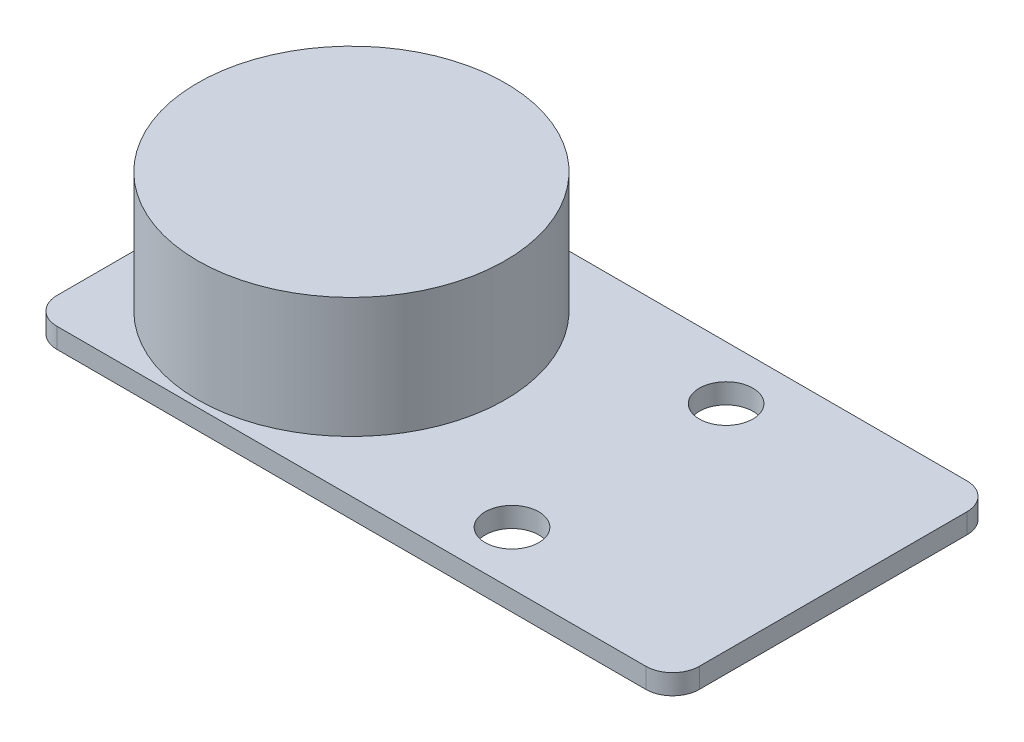
ISO-10303-21;
HEADER;
FILE_DESCRIPTION(('STEP AP214'),'2;1');
FILE_NAME('part.step','',(''),(''),'','','');
FILE_SCHEMA(('AUTOMOTIVE_DESIGN { 1 0 10303 214 1 1 1 1 }'));
ENDSEC;
DATA;
#1=APPLICATION_CONTEXT('core data for automotive mechanical design processes');
#2=APPLICATION_PROTOCOL_DEFINITION('international standard','automotive_design',2000,#1);
#3=PRODUCT_CONTEXT('',#1,'mechanical');
#4=PRODUCT('Part','Part','',(#3));
#5=PRODUCT_RELATED_PRODUCT_CATEGORY('part','',(#4));
#6=PRODUCT_DEFINITION_FORMATION('','',#4);
#7=PRODUCT_DEFINITION_CONTEXT('part definition',#1,'design');
#8=PRODUCT_DEFINITION('design','',#6,#7);
#9=PRODUCT_DEFINITION_SHAPE('','',#8);
#10=(LENGTH_UNIT() NAMED_UNIT(*) SI_UNIT(.MILLI.,.METRE.));
#11=(NAMED_UNIT(*) PLANE_ANGLE_UNIT() SI_UNIT($,.RADIAN.));
#12=(NAMED_UNIT(*) SI_UNIT($,.STERADIAN.) SOLID_ANGLE_UNIT());
#13=UNCERTAINTY_MEASURE_WITH_UNIT(LENGTH_MEASURE(1.E-05),#10,'distance_accuracy_value','');
#14=(GEOMETRIC_REPRESENTATION_CONTEXT(3) GLOBAL_UNCERTAINTY_ASSIGNED_CONTEXT((#13)) GLOBAL_UNIT_ASSIGNED_CONTEXT((#10,
#11,#12)) REPRESENTATION_CONTEXT('',''));
#15=CARTESIAN_POINT('',(0.,0.,0.));
#16=DIRECTION('',(0.,0.,1.));
#17=DIRECTION('',(1.,0.,0.));
#18=AXIS2_PLACEMENT_3D('',#15,#16,#17);
#19=CARTESIAN_POINT('',(-24.,1.5,12.));
#20=DIRECTION('',(1.,0.,0.));
#21=DIRECTION('',(0.,0.,-1.));
#22=AXIS2_PLACEMENT_3D('',#19,#20,#21);
#23=PLANE('',#22);
#24=DIRECTION('',(0.,0.,1.));
#25=VECTOR('',#24,1.);
#26=CARTESIAN_POINT('',(-24.,1.5,12.));
#27=LINE('',#26,#25);
#28=CARTESIAN_POINT('',(-24.,1.5,-9.99999999999999));
#29=VERTEX_POINT('',#28);
#30=CARTESIAN_POINT('',(-24.,1.5,10.));
#31=VERTEX_POINT('',#30);
#32=EDGE_CURVE('E140',#29,#31,#27,.T.);
#33=ORIENTED_EDGE('',*,*,#32,.F.);
#34=DIRECTION('',(0.,-1.,0.));
#35=VECTOR('',#34,1.);
#36=CARTESIAN_POINT('',(-24.,1.5,-9.99999999999999));
#37=LINE('',#36,#35);
#38=CARTESIAN_POINT('',(-24.,0.,-9.99999999999999));
#39=VERTEX_POINT('',#38);
#40=EDGE_CURVE('E11',#29,#39,#37,.T.);
#41=ORIENTED_EDGE('',*,*,#40,.T.);
#42=DIRECTION('',(0.,0.,1.));
#43=VECTOR('',#42,1.);
#44=CARTESIAN_POINT('',(-24.,0.,12.));
#45=LINE('',#44,#43);
#46=CARTESIAN_POINT('',(-24.,0.,10.));
#47=VERTEX_POINT('',#46);
#48=EDGE_CURVE('E142',#39,#47,#45,.T.);
#49=ORIENTED_EDGE('',*,*,#48,.T.);
#50=DIRECTION('',(0.,-1.,0.));
#51=VECTOR('',#50,1.);
#52=CARTESIAN_POINT('',(-24.,1.5,10.));
#53=LINE('',#52,#51);
#54=EDGE_CURVE('E48',#47,#31,#53,.F.);
#55=ORIENTED_EDGE('',*,*,#54,.T.);
#56=EDGE_LOOP('',(#33,#41,#49,#55));
#57=FACE_BOUND('',#56,.T.);
#58=ADVANCED_FACE('F39',(#57),#23,.F.);
#59=CARTESIAN_POINT('',(24.,1.5,12.));
#60=DIRECTION('',(0.,0.,-1.));
#61=DIRECTION('',(-1.,0.,0.));
#62=AXIS2_PLACEMENT_3D('',#59,#60,#61);
#63=PLANE('',#62);
#64=DIRECTION('',(1.,0.,0.));
#65=VECTOR('',#64,1.);
#66=CARTESIAN_POINT('',(24.,0.,12.));
#67=LINE('',#66,#65);
#68=CARTESIAN_POINT('',(-22.,0.,12.));
#69=VERTEX_POINT('',#68);
#70=CARTESIAN_POINT('',(22.,0.,12.));
#71=VERTEX_POINT('',#70);
#72=EDGE_CURVE('E136',#69,#71,#67,.T.);
#73=ORIENTED_EDGE('',*,*,#72,.T.);
#74=DIRECTION('',(0.,-1.,0.));
#75=VECTOR('',#74,1.);
#76=CARTESIAN_POINT('',(22.,1.5,12.));
#77=LINE('',#76,#75);
#78=CARTESIAN_POINT('',(22.,1.5,12.));
#79=VERTEX_POINT('',#78);
#80=EDGE_CURVE('E112',#71,#79,#77,.F.);
#81=ORIENTED_EDGE('',*,*,#80,.T.);
#82=DIRECTION('',(1.,0.,0.));
#83=VECTOR('',#82,1.);
#84=CARTESIAN_POINT('',(24.,1.5,12.));
#85=LINE('',#84,#83);
#86=CARTESIAN_POINT('',(-22.,1.5,12.));
#87=VERTEX_POINT('',#86);
#88=EDGE_CURVE('E192',#87,#79,#85,.T.);
#89=ORIENTED_EDGE('',*,*,#88,.F.);
#90=DIRECTION('',(0.,-1.,0.));
#91=VECTOR('',#90,1.);
#92=CARTESIAN_POINT('',(-22.,1.5,12.));
#93=LINE('',#92,#91);
#94=EDGE_CURVE('E118',#87,#69,#93,.T.);
#95=ORIENTED_EDGE('',*,*,#94,.T.);
#96=EDGE_LOOP('',(#73,#81,#89,#95));
#97=FACE_BOUND('',#96,.T.);
#98=ADVANCED_FACE('F196',(#97),#63,.F.);
#99=CARTESIAN_POINT('',(24.,1.5,12.));
#100=DIRECTION('',(-1.,0.,0.));
#101=DIRECTION('',(0.,0.,1.));
#102=AXIS2_PLACEMENT_3D('',#99,#100,#101);
#103=PLANE('',#102);
#104=DIRECTION('',(0.,0.,-1.));
#105=VECTOR('',#104,1.);
#106=CARTESIAN_POINT('',(24.,1.5,12.));
#107=LINE('',#106,#105);
#108=CARTESIAN_POINT('',(24.,1.5,10.));
#109=VERTEX_POINT('',#108);
#110=CARTESIAN_POINT('',(24.,1.5,-10.));
#111=VERTEX_POINT('',#110);
#112=EDGE_CURVE('E127',#109,#111,#107,.T.);
#113=ORIENTED_EDGE('',*,*,#112,.F.);
#114=DIRECTION('',(0.,-1.,0.));
#115=VECTOR('',#114,1.);
#116=CARTESIAN_POINT('',(24.,1.5,10.));
#117=LINE('',#116,#115);
#118=CARTESIAN_POINT('',(24.,0.,10.));
#119=VERTEX_POINT('',#118);
#120=EDGE_CURVE('E111',#109,#119,#117,.T.);
#121=ORIENTED_EDGE('',*,*,#120,.T.);
#122=DIRECTION('',(0.,0.,-1.));
#123=VECTOR('',#122,1.);
#124=CARTESIAN_POINT('',(24.,0.,12.));
#125=LINE('',#124,#123);
#126=CARTESIAN_POINT('',(24.,0.,-10.));
#127=VERTEX_POINT('',#126);
#128=EDGE_CURVE('E125',#119,#127,#125,.T.);
#129=ORIENTED_EDGE('',*,*,#128,.T.);
#130=DIRECTION('',(0.,-1.,0.));
#131=VECTOR('',#130,1.);
#132=CARTESIAN_POINT('',(24.,1.5,-10.));
#133=LINE('',#132,#131);
#134=EDGE_CURVE('E130',#127,#111,#133,.F.);
#135=ORIENTED_EDGE('',*,*,#134,.T.);
#136=EDGE_LOOP('',(#113,#121,#129,#135));
#137=FACE_BOUND('',#136,.T.);
#138=ADVANCED_FACE('F124',(#137),#103,.F.);
#139=CARTESIAN_POINT('',(24.,1.5,-12.));
#140=DIRECTION('',(0.,0.,1.));
#141=DIRECTION('',(1.,0.,0.));
#142=AXIS2_PLACEMENT_3D('',#139,#140,#141);
#143=PLANE('',#142);
#144=DIRECTION('',(-1.,0.,0.));
#145=VECTOR('',#144,1.);
#146=CARTESIAN_POINT('',(24.,1.5,-12.));
#147=LINE('',#146,#145);
#148=CARTESIAN_POINT('',(22.,1.5,-12.));
#149=VERTEX_POINT('',#148);
#150=CARTESIAN_POINT('',(-22.,1.5,-12.));
#151=VERTEX_POINT('',#150);
#152=EDGE_CURVE('E147',#149,#151,#147,.T.);
#153=ORIENTED_EDGE('',*,*,#152,.F.);
#154=DIRECTION('',(0.,-1.,0.));
#155=VECTOR('',#154,1.);
#156=CARTESIAN_POINT('',(22.,1.5,-12.));
#157=LINE('',#156,#155);
#158=CARTESIAN_POINT('',(22.,0.,-12.));
#159=VERTEX_POINT('',#158);
#160=EDGE_CURVE('E174',#149,#159,#157,.T.);
#161=ORIENTED_EDGE('',*,*,#160,.T.);
#162=DIRECTION('',(-1.,0.,0.));
#163=VECTOR('',#162,1.);
#164=CARTESIAN_POINT('',(24.,0.,-12.));
#165=LINE('',#164,#163);
#166=CARTESIAN_POINT('',(-22.,0.,-12.));
#167=VERTEX_POINT('',#166);
#168=EDGE_CURVE('E135',#159,#167,#165,.T.);
#169=ORIENTED_EDGE('',*,*,#168,.T.);
#170=DIRECTION('',(0.,-1.,0.));
#171=VECTOR('',#170,1.);
#172=CARTESIAN_POINT('',(-22.,1.5,-12.));
#173=LINE('',#172,#171);
#174=EDGE_CURVE('E55',#167,#151,#173,.F.);
#175=ORIENTED_EDGE('',*,*,#174,.T.);
#176=EDGE_LOOP('',(#153,#161,#169,#175));
#177=FACE_BOUND('',#176,.T.);
#178=ADVANCED_FACE('F241',(#177),#143,.F.);
#179=CARTESIAN_POINT('',(0.,1.5,0.));
#180=DIRECTION('',(0.,1.,0.));
#181=DIRECTION('',(0.,0.,1.));
#182=AXIS2_PLACEMENT_3D('',#179,#180,#181);
#183=PLANE('',#182);
#184=CARTESIAN_POINT('',(-12.,1.5,0.));
#185=DIRECTION('',(0.,1.,0.));
#186=DIRECTION('',(0.,0.,1.));
#187=AXIS2_PLACEMENT_3D('',#184,#185,#186);
#188=CIRCLE('',#187,11.5);
#189=CARTESIAN_POINT('',(-12.,1.5,11.5));
#190=VERTEX_POINT('',#189);
#191=EDGE_CURVE('E222',#190,#190,#188,.T.);
#192=ORIENTED_EDGE('',*,*,#191,.F.);
#193=EDGE_LOOP('',(#192));
#194=FACE_BOUND('',#193,.T.);
#195=CARTESIAN_POINT('',(8.,1.5,-8.));
#196=DIRECTION('',(0.,1.,0.));
#197=DIRECTION('',(0.,0.,1.));
#198=AXIS2_PLACEMENT_3D('',#195,#196,#197);
#199=CIRCLE('',#198,2.);
#200=CARTESIAN_POINT('',(8.,1.5,-6.));
#201=VERTEX_POINT('',#200);
#202=EDGE_CURVE('E201',#201,#201,#199,.T.);
#203=ORIENTED_EDGE('',*,*,#202,.F.);
#204=EDGE_LOOP('',(#203));
#205=FACE_BOUND('',#204,.T.);
#206=CARTESIAN_POINT('',(8.,1.5,8.00000000000001));
#207=DIRECTION('',(0.,1.,0.));
#208=DIRECTION('',(0.,0.,-1.));
#209=AXIS2_PLACEMENT_3D('',#206,#207,#208);
#210=CIRCLE('',#209,2.);
#211=CARTESIAN_POINT('',(8.,1.5,6.00000000000001));
#212=VERTEX_POINT('',#211);
#213=EDGE_CURVE('E214',#212,#212,#210,.T.);
#214=ORIENTED_EDGE('',*,*,#213,.F.);
#215=EDGE_LOOP('',(#214));
#216=FACE_BOUND('',#215,.T.);
#217=ORIENTED_EDGE('',*,*,#88,.T.);
#218=CARTESIAN_POINT('',(22.,1.5,10.));
#219=DIRECTION('',(0.,1.,0.));
#220=DIRECTION('',(0.,0.,1.));
#221=AXIS2_PLACEMENT_3D('',#218,#219,#220);
#222=CIRCLE('',#221,2.);
#223=EDGE_CURVE('E169',#79,#109,#222,.T.);
#224=ORIENTED_EDGE('',*,*,#223,.T.);
#225=ORIENTED_EDGE('',*,*,#112,.T.);
#226=CARTESIAN_POINT('',(22.,1.5,-10.));
#227=DIRECTION('',(0.,1.,0.));
#228=DIRECTION('',(0.,0.,1.));
#229=AXIS2_PLACEMENT_3D('',#226,#227,#228);
#230=CIRCLE('',#229,2.);
#231=EDGE_CURVE('E62',#111,#149,#230,.T.);
#232=ORIENTED_EDGE('',*,*,#231,.T.);
#233=ORIENTED_EDGE('',*,*,#152,.T.);
#234=CARTESIAN_POINT('',(-22.,1.5,-9.99999999999999));
#235=DIRECTION('',(0.,1.,0.));
#236=DIRECTION('',(0.,0.,1.));
#237=AXIS2_PLACEMENT_3D('',#234,#235,#236);
#238=CIRCLE('',#237,2.);
#239=EDGE_CURVE('E164',#151,#29,#238,.T.);
#240=ORIENTED_EDGE('',*,*,#239,.T.);
#241=ORIENTED_EDGE('',*,*,#32,.T.);
#242=CARTESIAN_POINT('',(-22.,1.5,10.));
#243=DIRECTION('',(0.,1.,0.));
#244=DIRECTION('',(0.,0.,1.));
#245=AXIS2_PLACEMENT_3D('',#242,#243,#244);
#246=CIRCLE('',#245,2.);
#247=EDGE_CURVE('E161',#31,#87,#246,.T.);
#248=ORIENTED_EDGE('',*,*,#247,.T.);
#249=EDGE_LOOP('',(#217,#224,#225,#232,#233,#240,#241,#248));
#250=FACE_BOUND('',#249,.T.);
#251=ADVANCED_FACE('F188',(#194,#205,#216,#250),#183,.T.);
#252=CARTESIAN_POINT('',(0.,0.,0.));
#253=DIRECTION('',(0.,1.,0.));
#254=DIRECTION('',(0.,0.,1.));
#255=AXIS2_PLACEMENT_3D('',#252,#253,#254);
#256=PLANE('',#255);
#257=CARTESIAN_POINT('',(8.,0.,-8.));
#258=DIRECTION('',(0.,1.,0.));
#259=DIRECTION('',(0.,0.,1.));
#260=AXIS2_PLACEMENT_3D('',#257,#258,#259);
#261=CIRCLE('',#260,2.);
#262=CARTESIAN_POINT('',(8.,0.,-6.));
#263=VERTEX_POINT('',#262);
#264=EDGE_CURVE('E198',#263,#263,#261,.F.);
#265=ORIENTED_EDGE('',*,*,#264,.F.);
#266=EDGE_LOOP('',(#265));
#267=FACE_BOUND('',#266,.T.);
#268=CARTESIAN_POINT('',(8.,0.,8.00000000000001));
#269=DIRECTION('',(0.,1.,0.));
#270=DIRECTION('',(0.,0.,1.));
#271=AXIS2_PLACEMENT_3D('',#268,#269,#270);
#272=CIRCLE('',#271,2.);
#273=CARTESIAN_POINT('',(8.,0.,10.));
#274=VERTEX_POINT('',#273);
#275=EDGE_CURVE('E210',#274,#274,#272,.F.);
#276=ORIENTED_EDGE('',*,*,#275,.F.);
#277=EDGE_LOOP('',(#276));
#278=FACE_BOUND('',#277,.T.);
#279=ORIENTED_EDGE('',*,*,#128,.F.);
#280=CARTESIAN_POINT('',(22.,0.,10.));
#281=DIRECTION('',(0.,1.,0.));
#282=DIRECTION('',(0.,0.,1.));
#283=AXIS2_PLACEMENT_3D('',#280,#281,#282);
#284=CIRCLE('',#283,2.);
#285=EDGE_CURVE('E107',#119,#71,#284,.F.);
#286=ORIENTED_EDGE('',*,*,#285,.T.);
#287=ORIENTED_EDGE('',*,*,#72,.F.);
#288=CARTESIAN_POINT('',(-22.,0.,10.));
#289=DIRECTION('',(0.,1.,0.));
#290=DIRECTION('',(0.,0.,1.));
#291=AXIS2_PLACEMENT_3D('',#288,#289,#290);
#292=CIRCLE('',#291,2.);
#293=EDGE_CURVE('E129',#69,#47,#292,.F.);
#294=ORIENTED_EDGE('',*,*,#293,.T.);
#295=ORIENTED_EDGE('',*,*,#48,.F.);
#296=CARTESIAN_POINT('',(-22.,0.,-9.99999999999999));
#297=DIRECTION('',(0.,1.,0.));
#298=DIRECTION('',(0.,0.,1.));
#299=AXIS2_PLACEMENT_3D('',#296,#297,#298);
#300=CIRCLE('',#299,2.);
#301=EDGE_CURVE('E151',#39,#167,#300,.F.);
#302=ORIENTED_EDGE('',*,*,#301,.T.);
#303=ORIENTED_EDGE('',*,*,#168,.F.);
#304=CARTESIAN_POINT('',(22.,0.,-10.));
#305=DIRECTION('',(0.,1.,0.));
#306=DIRECTION('',(0.,0.,1.));
#307=AXIS2_PLACEMENT_3D('',#304,#305,#306);
#308=CIRCLE('',#307,2.);
#309=EDGE_CURVE('E119',#159,#127,#308,.F.);
#310=ORIENTED_EDGE('',*,*,#309,.T.);
#311=EDGE_LOOP('',(#279,#286,#287,#294,#295,#302,#303,#310));
#312=FACE_BOUND('',#311,.T.);
#313=ADVANCED_FACE('F132',(#267,#278,#312),#256,.F.);
#314=CARTESIAN_POINT('',(22.,1.5,10.));
#315=DIRECTION('',(0.,-1.,0.));
#316=DIRECTION('',(0.,0.,-1.));
#317=AXIS2_PLACEMENT_3D('',#314,#315,#316);
#318=CYLINDRICAL_SURFACE('',#317,2.);
#319=ORIENTED_EDGE('',*,*,#223,.F.);
#320=ORIENTED_EDGE('',*,*,#80,.F.);
#321=ORIENTED_EDGE('',*,*,#285,.F.);
#322=ORIENTED_EDGE('',*,*,#120,.F.);
#323=EDGE_LOOP('',(#319,#320,#321,#322));
#324=FACE_BOUND('',#323,.T.);
#325=ADVANCED_FACE('F110',(#324),#318,.T.);
#326=CARTESIAN_POINT('',(22.,1.5,-10.));
#327=DIRECTION('',(0.,-1.,0.));
#328=DIRECTION('',(0.,0.,-1.));
#329=AXIS2_PLACEMENT_3D('',#326,#327,#328);
#330=CYLINDRICAL_SURFACE('',#329,2.);
#331=ORIENTED_EDGE('',*,*,#231,.F.);
#332=ORIENTED_EDGE('',*,*,#134,.F.);
#333=ORIENTED_EDGE('',*,*,#309,.F.);
#334=ORIENTED_EDGE('',*,*,#160,.F.);
#335=EDGE_LOOP('',(#331,#332,#333,#334));
#336=FACE_BOUND('',#335,.T.);
#337=ADVANCED_FACE('F259',(#336),#330,.T.);
#338=CARTESIAN_POINT('',(-22.,1.5,-9.99999999999999));
#339=DIRECTION('',(0.,-1.,0.));
#340=DIRECTION('',(0.,0.,-1.));
#341=AXIS2_PLACEMENT_3D('',#338,#339,#340);
#342=CYLINDRICAL_SURFACE('',#341,2.);
#343=ORIENTED_EDGE('',*,*,#239,.F.);
#344=ORIENTED_EDGE('',*,*,#174,.F.);
#345=ORIENTED_EDGE('',*,*,#301,.F.);
#346=ORIENTED_EDGE('',*,*,#40,.F.);
#347=EDGE_LOOP('',(#343,#344,#345,#346));
#348=FACE_BOUND('',#347,.T.);
#349=ADVANCED_FACE('F272',(#348),#342,.T.);
#350=CARTESIAN_POINT('',(-22.,1.5,10.));
#351=DIRECTION('',(0.,-1.,0.));
#352=DIRECTION('',(0.,0.,-1.));
#353=AXIS2_PLACEMENT_3D('',#350,#351,#352);
#354=CYLINDRICAL_SURFACE('',#353,2.);
#355=ORIENTED_EDGE('',*,*,#247,.F.);
#356=ORIENTED_EDGE('',*,*,#54,.F.);
#357=ORIENTED_EDGE('',*,*,#293,.F.);
#358=ORIENTED_EDGE('',*,*,#94,.F.);
#359=EDGE_LOOP('',(#355,#356,#357,#358));
#360=FACE_BOUND('',#359,.T.);
#361=ADVANCED_FACE('F41',(#360),#354,.T.);
#362=CARTESIAN_POINT('',(8.,-0.000999999999999916,8.00000000000001));
#363=DIRECTION('',(0.,1.,0.));
#364=DIRECTION('',(0.,0.,1.));
#365=AXIS2_PLACEMENT_3D('',#362,#363,#364);
#366=CYLINDRICAL_SURFACE('',#365,2.);
#367=ORIENTED_EDGE('',*,*,#213,.T.);
#368=EDGE_LOOP('',(#367));
#369=FACE_BOUND('',#368,.T.);
#370=ORIENTED_EDGE('',*,*,#275,.T.);
#371=EDGE_LOOP('',(#370));
#372=FACE_BOUND('',#371,.T.);
#373=ADVANCED_FACE('F247',(#369,#372),#366,.F.);
#374=CARTESIAN_POINT('',(8.,-0.000999999999999916,-8.));
#375=DIRECTION('',(0.,1.,0.));
#376=DIRECTION('',(0.,0.,1.));
#377=AXIS2_PLACEMENT_3D('',#374,#375,#376);
#378=CYLINDRICAL_SURFACE('',#377,2.);
#379=ORIENTED_EDGE('',*,*,#202,.T.);
#380=EDGE_LOOP('',(#379));
#381=FACE_BOUND('',#380,.T.);
#382=ORIENTED_EDGE('',*,*,#264,.T.);
#383=EDGE_LOOP('',(#382));
#384=FACE_BOUND('',#383,.T.);
#385=ADVANCED_FACE('F235',(#381,#384),#378,.F.);
#386=CARTESIAN_POINT('',(-12.,10.5,0.));
#387=DIRECTION('',(0.,-1.,0.));
#388=DIRECTION('',(0.,0.,-1.));
#389=AXIS2_PLACEMENT_3D('',#386,#387,#388);
#390=CYLINDRICAL_SURFACE('',#389,11.5);
#391=CARTESIAN_POINT('',(-12.,10.5,0.));
#392=DIRECTION('',(0.,1.,0.));
#393=DIRECTION('',(0.,0.,1.));
#394=AXIS2_PLACEMENT_3D('',#391,#392,#393);
#395=CIRCLE('',#394,11.5);
#396=CARTESIAN_POINT('',(-12.,10.5,11.5));
#397=VERTEX_POINT('',#396);
#398=EDGE_CURVE('E217',#397,#397,#395,.T.);
#399=ORIENTED_EDGE('',*,*,#398,.F.);
#400=EDGE_LOOP('',(#399));
#401=FACE_BOUND('',#400,.T.);
#402=ORIENTED_EDGE('',*,*,#191,.T.);
#403=EDGE_LOOP('',(#402));
#404=FACE_BOUND('',#403,.T.);
#405=ADVANCED_FACE('F232',(#401,#404),#390,.T.);
#406=CARTESIAN_POINT('',(-12.,10.5,0.));
#407=DIRECTION('',(0.,1.,0.));
#408=DIRECTION('',(0.,0.,1.));
#409=AXIS2_PLACEMENT_3D('',#406,#407,#408);
#410=PLANE('',#409);
#411=ORIENTED_EDGE('',*,*,#398,.T.);
#412=EDGE_LOOP('',(#411));
#413=FACE_BOUND('',#412,.T.);
#414=ADVANCED_FACE('F230',(#413),#410,.T.);
#415=CLOSED_SHELL('',(#58,#98,#138,#178,#251,#313,#325,#337,#349,#361,#373,#385,#405,#414));
#416=MANIFOLD_SOLID_BREP('B2',#415);
#417=ADVANCED_BREP_SHAPE_REPRESENTATION('',(#18,#416),#14);
#418=SHAPE_DEFINITION_REPRESENTATION(#9,#417);
ENDSEC;
END-ISO-10303-21;
